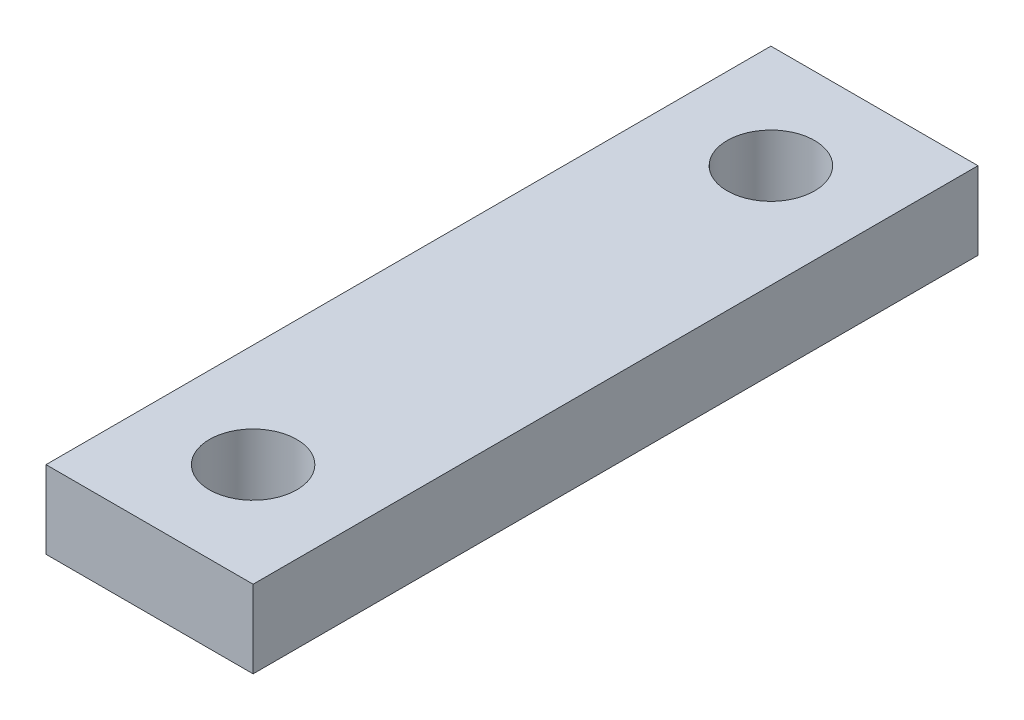
ISO-10303-21;
HEADER;
FILE_DESCRIPTION(('STEP AP214'),'2;1');
FILE_NAME('part.step','',(''),(''),'','','');
FILE_SCHEMA(('AUTOMOTIVE_DESIGN { 1 0 10303 214 1 1 1 1 }'));
ENDSEC;
DATA;
#1=APPLICATION_CONTEXT('core data for automotive mechanical design processes');
#2=APPLICATION_PROTOCOL_DEFINITION('international standard','automotive_design',2000,#1);
#3=PRODUCT_CONTEXT('',#1,'mechanical');
#4=PRODUCT('Part','Part','',(#3));
#5=PRODUCT_RELATED_PRODUCT_CATEGORY('part','',(#4));
#6=PRODUCT_DEFINITION_FORMATION('','',#4);
#7=PRODUCT_DEFINITION_CONTEXT('part definition',#1,'design');
#8=PRODUCT_DEFINITION('design','',#6,#7);
#9=PRODUCT_DEFINITION_SHAPE('','',#8);
#10=(LENGTH_UNIT() NAMED_UNIT(*) SI_UNIT(.MILLI.,.METRE.));
#11=(NAMED_UNIT(*) PLANE_ANGLE_UNIT() SI_UNIT($,.RADIAN.));
#12=(NAMED_UNIT(*) SI_UNIT($,.STERADIAN.) SOLID_ANGLE_UNIT());
#13=UNCERTAINTY_MEASURE_WITH_UNIT(LENGTH_MEASURE(1.E-05),#10,'distance_accuracy_value','');
#14=(GEOMETRIC_REPRESENTATION_CONTEXT(3) GLOBAL_UNCERTAINTY_ASSIGNED_CONTEXT((#13)) GLOBAL_UNIT_ASSIGNED_CONTEXT((#10,
#11,#12)) REPRESENTATION_CONTEXT('',''));
#15=CARTESIAN_POINT('',(0.,0.,0.));
#16=DIRECTION('',(0.,0.,1.));
#17=DIRECTION('',(1.,0.,0.));
#18=AXIS2_PLACEMENT_3D('',#15,#16,#17);
#19=CARTESIAN_POINT('',(12.7,-4.7625,44.45));
#20=DIRECTION('',(-1.,0.,0.));
#21=DIRECTION('',(0.,0.,1.));
#22=AXIS2_PLACEMENT_3D('',#19,#20,#21);
#23=PLANE('',#22);
#24=DIRECTION('',(0.,1.,0.));
#25=VECTOR('',#24,1.);
#26=CARTESIAN_POINT('',(12.7,-4.7625,-44.45));
#27=LINE('',#26,#25);
#28=CARTESIAN_POINT('',(12.7,-4.7625,-44.45));
#29=VERTEX_POINT('',#28);
#30=CARTESIAN_POINT('',(12.7,4.7625,-44.45));
#31=VERTEX_POINT('',#30);
#32=EDGE_CURVE('E95',#29,#31,#27,.T.);
#33=ORIENTED_EDGE('',*,*,#32,.T.);
#34=DIRECTION('',(0.,0.,-1.));
#35=VECTOR('',#34,1.);
#36=CARTESIAN_POINT('',(12.7,4.7625,44.45));
#37=LINE('',#36,#35);
#38=CARTESIAN_POINT('',(12.7,4.7625,44.45));
#39=VERTEX_POINT('',#38);
#40=EDGE_CURVE('E11',#39,#31,#37,.T.);
#41=ORIENTED_EDGE('',*,*,#40,.F.);
#42=DIRECTION('',(0.,1.,0.));
#43=VECTOR('',#42,1.);
#44=CARTESIAN_POINT('',(12.7,-4.7625,44.45));
#45=LINE('',#44,#43);
#46=CARTESIAN_POINT('',(12.7,-4.7625,44.45));
#47=VERTEX_POINT('',#46);
#48=EDGE_CURVE('E83',#47,#39,#45,.T.);
#49=ORIENTED_EDGE('',*,*,#48,.F.);
#50=DIRECTION('',(0.,0.,-1.));
#51=VECTOR('',#50,1.);
#52=CARTESIAN_POINT('',(12.7,-4.7625,44.45));
#53=LINE('',#52,#51);
#54=EDGE_CURVE('E91',#47,#29,#53,.T.);
#55=ORIENTED_EDGE('',*,*,#54,.T.);
#56=EDGE_LOOP('',(#33,#41,#49,#55));
#57=FACE_BOUND('',#56,.T.);
#58=ADVANCED_FACE('F32',(#57),#23,.F.);
#59=CARTESIAN_POINT('',(-12.7,4.7625,44.45));
#60=DIRECTION('',(0.,-1.,0.));
#61=DIRECTION('',(0.,0.,-1.));
#62=AXIS2_PLACEMENT_3D('',#59,#60,#61);
#63=PLANE('',#62);
#64=CARTESIAN_POINT('',(0.,4.7625,31.75));
#65=DIRECTION('',(0.,1.,0.));
#66=DIRECTION('',(0.,0.,1.));
#67=AXIS2_PLACEMENT_3D('',#64,#65,#66);
#68=CIRCLE('',#67,5.35812999999999);
#69=CARTESIAN_POINT('',(0.,4.7625,37.10813));
#70=VERTEX_POINT('',#69);
#71=EDGE_CURVE('E117',#70,#70,#68,.T.);
#72=ORIENTED_EDGE('',*,*,#71,.F.);
#73=EDGE_LOOP('',(#72));
#74=FACE_BOUND('',#73,.T.);
#75=CARTESIAN_POINT('',(0.,4.7625,-31.75));
#76=DIRECTION('',(0.,1.,0.));
#77=DIRECTION('',(0.,0.,1.));
#78=AXIS2_PLACEMENT_3D('',#75,#76,#77);
#79=CIRCLE('',#78,5.35812999999999);
#80=CARTESIAN_POINT('',(0.,4.7625,-26.39187));
#81=VERTEX_POINT('',#80);
#82=EDGE_CURVE('E111',#81,#81,#79,.T.);
#83=ORIENTED_EDGE('',*,*,#82,.F.);
#84=EDGE_LOOP('',(#83));
#85=FACE_BOUND('',#84,.T.);
#86=DIRECTION('',(-1.,0.,0.));
#87=VECTOR('',#86,1.);
#88=CARTESIAN_POINT('',(-12.7,4.7625,-44.45));
#89=LINE('',#88,#87);
#90=CARTESIAN_POINT('',(-12.7,4.7625,-44.45));
#91=VERTEX_POINT('',#90);
#92=EDGE_CURVE('E87',#31,#91,#89,.T.);
#93=ORIENTED_EDGE('',*,*,#92,.T.);
#94=DIRECTION('',(0.,0.,-1.));
#95=VECTOR('',#94,1.);
#96=CARTESIAN_POINT('',(-12.7,4.7625,44.45));
#97=LINE('',#96,#95);
#98=CARTESIAN_POINT('',(-12.7,4.7625,44.45));
#99=VERTEX_POINT('',#98);
#100=EDGE_CURVE('E40',#99,#91,#97,.T.);
#101=ORIENTED_EDGE('',*,*,#100,.F.);
#102=DIRECTION('',(-1.,0.,0.));
#103=VECTOR('',#102,1.);
#104=CARTESIAN_POINT('',(-12.7,4.7625,44.45));
#105=LINE('',#104,#103);
#106=EDGE_CURVE('E78',#39,#99,#105,.T.);
#107=ORIENTED_EDGE('',*,*,#106,.F.);
#108=ORIENTED_EDGE('',*,*,#40,.T.);
#109=EDGE_LOOP('',(#93,#101,#107,#108));
#110=FACE_BOUND('',#109,.T.);
#111=ADVANCED_FACE('F86',(#74,#85,#110),#63,.F.);
#112=CARTESIAN_POINT('',(-12.7,-4.7625,44.45));
#113=DIRECTION('',(1.,0.,0.));
#114=DIRECTION('',(0.,0.,-1.));
#115=AXIS2_PLACEMENT_3D('',#112,#113,#114);
#116=PLANE('',#115);
#117=DIRECTION('',(0.,-1.,0.));
#118=VECTOR('',#117,1.);
#119=CARTESIAN_POINT('',(-12.7,-4.7625,-44.45));
#120=LINE('',#119,#118);
#121=CARTESIAN_POINT('',(-12.7,-4.7625,-44.45));
#122=VERTEX_POINT('',#121);
#123=EDGE_CURVE('E65',#91,#122,#120,.T.);
#124=ORIENTED_EDGE('',*,*,#123,.T.);
#125=DIRECTION('',(0.,0.,-1.));
#126=VECTOR('',#125,1.);
#127=CARTESIAN_POINT('',(-12.7,-4.7625,44.45));
#128=LINE('',#127,#126);
#129=CARTESIAN_POINT('',(-12.7,-4.7625,44.45));
#130=VERTEX_POINT('',#129);
#131=EDGE_CURVE('E88',#130,#122,#128,.T.);
#132=ORIENTED_EDGE('',*,*,#131,.F.);
#133=DIRECTION('',(0.,-1.,0.));
#134=VECTOR('',#133,1.);
#135=CARTESIAN_POINT('',(-12.7,-4.7625,44.45));
#136=LINE('',#135,#134);
#137=EDGE_CURVE('E81',#99,#130,#136,.T.);
#138=ORIENTED_EDGE('',*,*,#137,.F.);
#139=ORIENTED_EDGE('',*,*,#100,.T.);
#140=EDGE_LOOP('',(#124,#132,#138,#139));
#141=FACE_BOUND('',#140,.T.);
#142=ADVANCED_FACE('F89',(#141),#116,.F.);
#143=CARTESIAN_POINT('',(-12.7,-4.7625,44.45));
#144=DIRECTION('',(0.,1.,0.));
#145=DIRECTION('',(0.,0.,1.));
#146=AXIS2_PLACEMENT_3D('',#143,#144,#145);
#147=PLANE('',#146);
#148=CARTESIAN_POINT('',(0.,-4.7625,31.75));
#149=DIRECTION('',(0.,1.,0.));
#150=DIRECTION('',(0.,0.,1.));
#151=AXIS2_PLACEMENT_3D('',#148,#149,#150);
#152=CIRCLE('',#151,5.35813);
#153=CARTESIAN_POINT('',(0.,-4.7625,37.10813));
#154=VERTEX_POINT('',#153);
#155=EDGE_CURVE('E114',#154,#154,#152,.T.);
#156=ORIENTED_EDGE('',*,*,#155,.T.);
#157=EDGE_LOOP('',(#156));
#158=FACE_BOUND('',#157,.T.);
#159=CARTESIAN_POINT('',(0.,-4.7625,-31.75));
#160=DIRECTION('',(0.,1.,0.));
#161=DIRECTION('',(0.,0.,1.));
#162=AXIS2_PLACEMENT_3D('',#159,#160,#161);
#163=CIRCLE('',#162,5.35813);
#164=CARTESIAN_POINT('',(0.,-4.7625,-26.39187));
#165=VERTEX_POINT('',#164);
#166=EDGE_CURVE('E98',#165,#165,#163,.T.);
#167=ORIENTED_EDGE('',*,*,#166,.T.);
#168=EDGE_LOOP('',(#167));
#169=FACE_BOUND('',#168,.T.);
#170=DIRECTION('',(1.,0.,0.));
#171=VECTOR('',#170,1.);
#172=CARTESIAN_POINT('',(-12.7,-4.7625,-44.45));
#173=LINE('',#172,#171);
#174=EDGE_CURVE('E71',#122,#29,#173,.T.);
#175=ORIENTED_EDGE('',*,*,#174,.T.);
#176=ORIENTED_EDGE('',*,*,#54,.F.);
#177=DIRECTION('',(1.,0.,0.));
#178=VECTOR('',#177,1.);
#179=CARTESIAN_POINT('',(-12.7,-4.7625,44.45));
#180=LINE('',#179,#178);
#181=EDGE_CURVE('E48',#130,#47,#180,.T.);
#182=ORIENTED_EDGE('',*,*,#181,.F.);
#183=ORIENTED_EDGE('',*,*,#131,.T.);
#184=EDGE_LOOP('',(#175,#176,#182,#183));
#185=FACE_BOUND('',#184,.T.);
#186=ADVANCED_FACE('F103',(#158,#169,#185),#147,.F.);
#187=CARTESIAN_POINT('',(12.7,4.7625,44.45));
#188=DIRECTION('',(0.,0.,-1.));
#189=DIRECTION('',(-1.,0.,0.));
#190=AXIS2_PLACEMENT_3D('',#187,#188,#189);
#191=PLANE('',#190);
#192=ORIENTED_EDGE('',*,*,#48,.T.);
#193=ORIENTED_EDGE('',*,*,#106,.T.);
#194=ORIENTED_EDGE('',*,*,#137,.T.);
#195=ORIENTED_EDGE('',*,*,#181,.T.);
#196=EDGE_LOOP('',(#192,#193,#194,#195));
#197=FACE_BOUND('',#196,.T.);
#198=ADVANCED_FACE('F79',(#197),#191,.F.);
#199=CARTESIAN_POINT('',(12.7,4.7625,-44.45));
#200=DIRECTION('',(0.,0.,-1.));
#201=DIRECTION('',(-1.,0.,0.));
#202=AXIS2_PLACEMENT_3D('',#199,#200,#201);
#203=PLANE('',#202);
#204=ORIENTED_EDGE('',*,*,#32,.F.);
#205=ORIENTED_EDGE('',*,*,#174,.F.);
#206=ORIENTED_EDGE('',*,*,#123,.F.);
#207=ORIENTED_EDGE('',*,*,#92,.F.);
#208=EDGE_LOOP('',(#204,#205,#206,#207));
#209=FACE_BOUND('',#208,.T.);
#210=ADVANCED_FACE('F106',(#209),#203,.T.);
#211=CARTESIAN_POINT('',(0.,4.7625,-31.75));
#212=DIRECTION('',(0.,1.,0.));
#213=DIRECTION('',(0.,0.,1.));
#214=AXIS2_PLACEMENT_3D('',#211,#212,#213);
#215=CYLINDRICAL_SURFACE('',#214,5.35812999999999);
#216=ORIENTED_EDGE('',*,*,#166,.F.);
#217=EDGE_LOOP('',(#216));
#218=FACE_BOUND('',#217,.T.);
#219=ORIENTED_EDGE('',*,*,#82,.T.);
#220=EDGE_LOOP('',(#219));
#221=FACE_BOUND('',#220,.T.);
#222=ADVANCED_FACE('F127',(#218,#221),#215,.F.);
#223=CARTESIAN_POINT('',(0.,4.7625,31.75));
#224=DIRECTION('',(0.,1.,0.));
#225=DIRECTION('',(0.,0.,1.));
#226=AXIS2_PLACEMENT_3D('',#223,#224,#225);
#227=CYLINDRICAL_SURFACE('',#226,5.35812999999999);
#228=ORIENTED_EDGE('',*,*,#155,.F.);
#229=EDGE_LOOP('',(#228));
#230=FACE_BOUND('',#229,.T.);
#231=ORIENTED_EDGE('',*,*,#71,.T.);
#232=EDGE_LOOP('',(#231));
#233=FACE_BOUND('',#232,.T.);
#234=ADVANCED_FACE('F121',(#230,#233),#227,.F.);
#235=CLOSED_SHELL('',(#58,#111,#142,#186,#198,#210,#222,#234));
#236=MANIFOLD_SOLID_BREP('B2',#235);
#237=ADVANCED_BREP_SHAPE_REPRESENTATION('',(#18,#236),#14);
#238=SHAPE_DEFINITION_REPRESENTATION(#9,#237);
ENDSEC;
END-ISO-10303-21;
